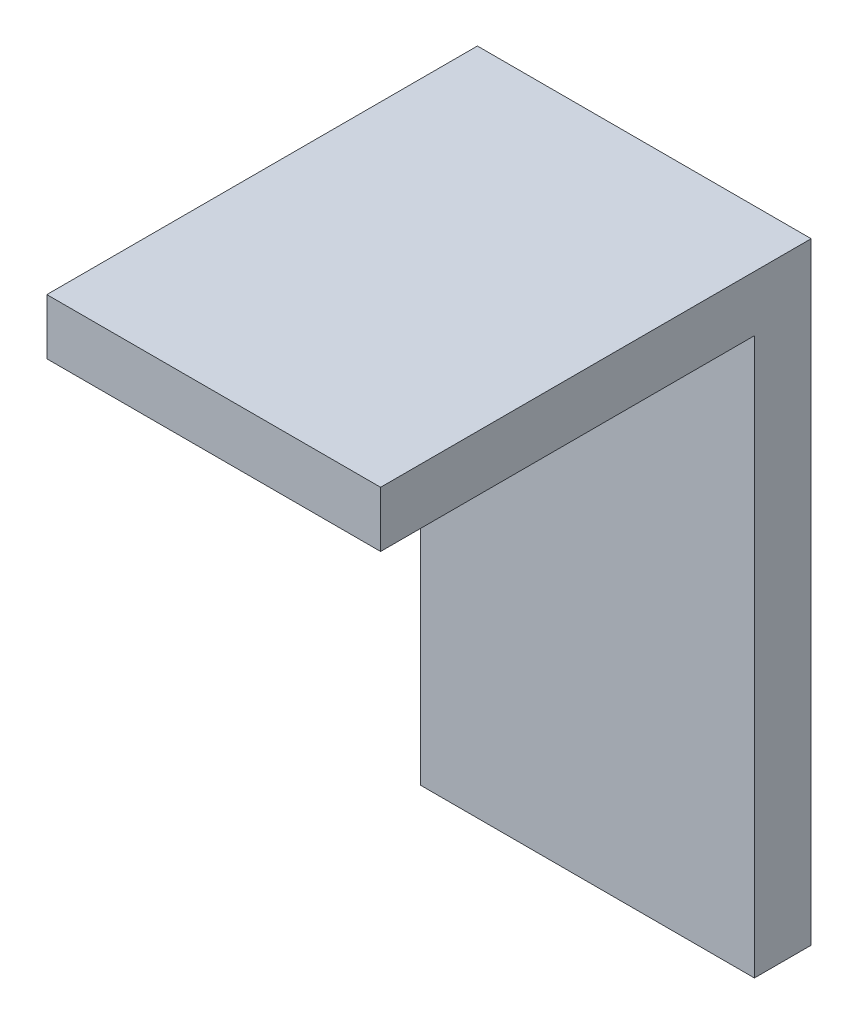
ISO-10303-21;
HEADER;
FILE_DESCRIPTION(('STEP AP214'),'2;1');
FILE_NAME('part.step','',(''),(''),'','','');
FILE_SCHEMA(('AUTOMOTIVE_DESIGN { 1 0 10303 214 1 1 1 1 }'));
ENDSEC;
DATA;
#1=APPLICATION_CONTEXT('core data for automotive mechanical design processes');
#2=APPLICATION_PROTOCOL_DEFINITION('international standard','automotive_design',2000,#1);
#3=PRODUCT_CONTEXT('',#1,'mechanical');
#4=PRODUCT('Part','Part','',(#3));
#5=PRODUCT_RELATED_PRODUCT_CATEGORY('part','',(#4));
#6=PRODUCT_DEFINITION_FORMATION('','',#4);
#7=PRODUCT_DEFINITION_CONTEXT('part definition',#1,'design');
#8=PRODUCT_DEFINITION('design','',#6,#7);
#9=PRODUCT_DEFINITION_SHAPE('','',#8);
#10=(LENGTH_UNIT() NAMED_UNIT(*) SI_UNIT(.MILLI.,.METRE.));
#11=(NAMED_UNIT(*) PLANE_ANGLE_UNIT() SI_UNIT($,.RADIAN.));
#12=(NAMED_UNIT(*) SI_UNIT($,.STERADIAN.) SOLID_ANGLE_UNIT());
#13=UNCERTAINTY_MEASURE_WITH_UNIT(LENGTH_MEASURE(1.E-05),#10,'distance_accuracy_value','');
#14=(GEOMETRIC_REPRESENTATION_CONTEXT(3) GLOBAL_UNCERTAINTY_ASSIGNED_CONTEXT((#13)) GLOBAL_UNIT_ASSIGNED_CONTEXT((#10,
#11,#12)) REPRESENTATION_CONTEXT('',''));
#15=CARTESIAN_POINT('',(0.,0.,0.));
#16=DIRECTION('',(0.,0.,1.));
#17=DIRECTION('',(1.,0.,0.));
#18=AXIS2_PLACEMENT_3D('',#15,#16,#17);
#19=CARTESIAN_POINT('',(-2.4,4.55,0.));
#20=DIRECTION('',(-1.,0.,0.));
#21=DIRECTION('',(0.,0.,1.));
#22=AXIS2_PLACEMENT_3D('',#19,#20,#21);
#23=PLANE('',#22);
#24=DIRECTION('',(0.,1.,0.));
#25=VECTOR('',#24,1.);
#26=CARTESIAN_POINT('',(-2.4,4.,0.));
#27=LINE('',#26,#25);
#28=CARTESIAN_POINT('',(-2.4,4.,0.));
#29=VERTEX_POINT('',#28);
#30=CARTESIAN_POINT('',(-2.4,4.55,0.));
#31=VERTEX_POINT('',#30);
#32=EDGE_CURVE('E11',#29,#31,#27,.T.);
#33=ORIENTED_EDGE('',*,*,#32,.F.);
#34=DIRECTION('',(0.,0.,-1.));
#35=VECTOR('',#34,1.);
#36=CARTESIAN_POINT('',(-2.4,4.,0.051));
#37=LINE('',#36,#35);
#38=CARTESIAN_POINT('',(-2.4,4.,0.051));
#39=VERTEX_POINT('',#38);
#40=EDGE_CURVE('E24',#39,#29,#37,.T.);
#41=ORIENTED_EDGE('',*,*,#40,.F.);
#42=DIRECTION('',(0.,-1.,0.));
#43=VECTOR('',#42,1.);
#44=CARTESIAN_POINT('',(-2.4,4.5,0.051));
#45=LINE('',#44,#43);
#46=CARTESIAN_POINT('',(-2.4,4.5,0.051));
#47=VERTEX_POINT('',#46);
#48=EDGE_CURVE('E87',#47,#39,#45,.T.);
#49=ORIENTED_EDGE('',*,*,#48,.F.);
#50=DIRECTION('',(0.,0.,-1.));
#51=VECTOR('',#50,1.);
#52=CARTESIAN_POINT('',(-2.4,4.5,0.387));
#53=LINE('',#52,#51);
#54=CARTESIAN_POINT('',(-2.4,4.5,0.387));
#55=VERTEX_POINT('',#54);
#56=EDGE_CURVE('E114',#55,#47,#53,.T.);
#57=ORIENTED_EDGE('',*,*,#56,.F.);
#58=DIRECTION('',(0.,-1.,0.));
#59=VECTOR('',#58,1.);
#60=CARTESIAN_POINT('',(-2.4,4.55,0.387));
#61=LINE('',#60,#59);
#62=CARTESIAN_POINT('',(-2.4,4.55,0.387));
#63=VERTEX_POINT('',#62);
#64=EDGE_CURVE('E111',#63,#55,#61,.T.);
#65=ORIENTED_EDGE('',*,*,#64,.F.);
#66=DIRECTION('',(0.,0.,1.));
#67=VECTOR('',#66,1.);
#68=CARTESIAN_POINT('',(-2.4,4.55,0.));
#69=LINE('',#68,#67);
#70=EDGE_CURVE('E108',#31,#63,#69,.T.);
#71=ORIENTED_EDGE('',*,*,#70,.F.);
#72=EDGE_LOOP('',(#33,#41,#49,#57,#65,#71));
#73=FACE_BOUND('',#72,.T.);
#74=ADVANCED_FACE('F17',(#73),#23,.T.);
#75=CARTESIAN_POINT('',(-2.1,4.,0.));
#76=DIRECTION('',(1.,0.,0.));
#77=DIRECTION('',(0.,0.,1.));
#78=AXIS2_PLACEMENT_3D('',#75,#76,#77);
#79=PLANE('',#78);
#80=DIRECTION('',(0.,-1.,0.));
#81=VECTOR('',#80,1.);
#82=CARTESIAN_POINT('',(-2.1,4.55,0.));
#83=LINE('',#82,#81);
#84=CARTESIAN_POINT('',(-2.1,4.55,0.));
#85=VERTEX_POINT('',#84);
#86=CARTESIAN_POINT('',(-2.1,4.,0.));
#87=VERTEX_POINT('',#86);
#88=EDGE_CURVE('E106',#85,#87,#83,.T.);
#89=ORIENTED_EDGE('',*,*,#88,.F.);
#90=DIRECTION('',(0.,0.,-1.));
#91=VECTOR('',#90,1.);
#92=CARTESIAN_POINT('',(-2.1,4.55,0.387));
#93=LINE('',#92,#91);
#94=CARTESIAN_POINT('',(-2.1,4.55,0.387));
#95=VERTEX_POINT('',#94);
#96=EDGE_CURVE('E103',#95,#85,#93,.T.);
#97=ORIENTED_EDGE('',*,*,#96,.F.);
#98=DIRECTION('',(0.,1.,0.));
#99=VECTOR('',#98,1.);
#100=CARTESIAN_POINT('',(-2.1,4.5,0.387));
#101=LINE('',#100,#99);
#102=CARTESIAN_POINT('',(-2.1,4.5,0.387));
#103=VERTEX_POINT('',#102);
#104=EDGE_CURVE('E100',#103,#95,#101,.T.);
#105=ORIENTED_EDGE('',*,*,#104,.F.);
#106=DIRECTION('',(0.,0.,1.));
#107=VECTOR('',#106,1.);
#108=CARTESIAN_POINT('',(-2.1,4.5,0.051));
#109=LINE('',#108,#107);
#110=CARTESIAN_POINT('',(-2.1,4.5,0.051));
#111=VERTEX_POINT('',#110);
#112=EDGE_CURVE('E72',#111,#103,#109,.T.);
#113=ORIENTED_EDGE('',*,*,#112,.F.);
#114=DIRECTION('',(0.,1.,0.));
#115=VECTOR('',#114,1.);
#116=CARTESIAN_POINT('',(-2.1,4.,0.051));
#117=LINE('',#116,#115);
#118=CARTESIAN_POINT('',(-2.1,4.,0.051));
#119=VERTEX_POINT('',#118);
#120=EDGE_CURVE('E66',#119,#111,#117,.T.);
#121=ORIENTED_EDGE('',*,*,#120,.F.);
#122=DIRECTION('',(0.,0.,1.));
#123=VECTOR('',#122,1.);
#124=CARTESIAN_POINT('',(-2.1,4.,0.));
#125=LINE('',#124,#123);
#126=EDGE_CURVE('E69',#87,#119,#125,.T.);
#127=ORIENTED_EDGE('',*,*,#126,.F.);
#128=EDGE_LOOP('',(#89,#97,#105,#113,#121,#127));
#129=FACE_BOUND('',#128,.T.);
#130=ADVANCED_FACE('F68',(#129),#79,.T.);
#131=CARTESIAN_POINT('',(-2.4,4.55,0.387));
#132=DIRECTION('',(0.,0.,1.));
#133=DIRECTION('',(0.,1.,0.));
#134=AXIS2_PLACEMENT_3D('',#131,#132,#133);
#135=PLANE('',#134);
#136=ORIENTED_EDGE('',*,*,#64,.T.);
#137=DIRECTION('',(-1.,0.,0.));
#138=VECTOR('',#137,1.);
#139=CARTESIAN_POINT('',(-2.1,4.5,0.387));
#140=LINE('',#139,#138);
#141=EDGE_CURVE('E83',#103,#55,#140,.T.);
#142=ORIENTED_EDGE('',*,*,#141,.F.);
#143=ORIENTED_EDGE('',*,*,#104,.T.);
#144=DIRECTION('',(1.,0.,0.));
#145=VECTOR('',#144,1.);
#146=CARTESIAN_POINT('',(-2.4,4.55,0.387));
#147=LINE('',#146,#145);
#148=EDGE_CURVE('E88',#63,#95,#147,.T.);
#149=ORIENTED_EDGE('',*,*,#148,.F.);
#150=EDGE_LOOP('',(#136,#142,#143,#149));
#151=FACE_BOUND('',#150,.T.);
#152=ADVANCED_FACE('F125',(#151),#135,.T.);
#153=CARTESIAN_POINT('',(-2.4,4.5,0.051));
#154=DIRECTION('',(0.,0.,1.));
#155=DIRECTION('',(0.,1.,0.));
#156=AXIS2_PLACEMENT_3D('',#153,#154,#155);
#157=PLANE('',#156);
#158=ORIENTED_EDGE('',*,*,#48,.T.);
#159=DIRECTION('',(-1.,0.,0.));
#160=VECTOR('',#159,1.);
#161=CARTESIAN_POINT('',(-2.1,4.,0.051));
#162=LINE('',#161,#160);
#163=EDGE_CURVE('E81',#119,#39,#162,.T.);
#164=ORIENTED_EDGE('',*,*,#163,.F.);
#165=ORIENTED_EDGE('',*,*,#120,.T.);
#166=DIRECTION('',(1.,0.,0.));
#167=VECTOR('',#166,1.);
#168=CARTESIAN_POINT('',(-2.4,4.5,0.051));
#169=LINE('',#168,#167);
#170=EDGE_CURVE('E89',#47,#111,#169,.T.);
#171=ORIENTED_EDGE('',*,*,#170,.F.);
#172=EDGE_LOOP('',(#158,#164,#165,#171));
#173=FACE_BOUND('',#172,.T.);
#174=ADVANCED_FACE('F86',(#173),#157,.T.);
#175=CARTESIAN_POINT('',(-2.1,4.55,0.));
#176=DIRECTION('',(0.,1.,0.));
#177=DIRECTION('',(0.,0.,1.));
#178=AXIS2_PLACEMENT_3D('',#175,#176,#177);
#179=PLANE('',#178);
#180=DIRECTION('',(1.,0.,0.));
#181=VECTOR('',#180,1.);
#182=CARTESIAN_POINT('',(-2.4,4.55,0.));
#183=LINE('',#182,#181);
#184=EDGE_CURVE('E93',#31,#85,#183,.T.);
#185=ORIENTED_EDGE('',*,*,#184,.F.);
#186=ORIENTED_EDGE('',*,*,#70,.T.);
#187=ORIENTED_EDGE('',*,*,#148,.T.);
#188=ORIENTED_EDGE('',*,*,#96,.T.);
#189=EDGE_LOOP('',(#185,#186,#187,#188));
#190=FACE_BOUND('',#189,.T.);
#191=ADVANCED_FACE('F121',(#190),#179,.T.);
#192=CARTESIAN_POINT('',(-2.4,4.,0.));
#193=DIRECTION('',(0.,-1.,0.));
#194=DIRECTION('',(0.,0.,1.));
#195=AXIS2_PLACEMENT_3D('',#192,#193,#194);
#196=PLANE('',#195);
#197=DIRECTION('',(-1.,0.,0.));
#198=VECTOR('',#197,1.);
#199=CARTESIAN_POINT('',(-2.1,4.,0.));
#200=LINE('',#199,#198);
#201=EDGE_CURVE('E82',#87,#29,#200,.T.);
#202=ORIENTED_EDGE('',*,*,#201,.F.);
#203=ORIENTED_EDGE('',*,*,#126,.T.);
#204=ORIENTED_EDGE('',*,*,#163,.T.);
#205=ORIENTED_EDGE('',*,*,#40,.T.);
#206=EDGE_LOOP('',(#202,#203,#204,#205));
#207=FACE_BOUND('',#206,.T.);
#208=ADVANCED_FACE('F80',(#207),#196,.T.);
#209=CARTESIAN_POINT('',(-2.4,4.5,0.051));
#210=DIRECTION('',(0.,-1.,0.));
#211=DIRECTION('',(0.,0.,1.));
#212=AXIS2_PLACEMENT_3D('',#209,#210,#211);
#213=PLANE('',#212);
#214=ORIENTED_EDGE('',*,*,#170,.T.);
#215=ORIENTED_EDGE('',*,*,#112,.T.);
#216=ORIENTED_EDGE('',*,*,#141,.T.);
#217=ORIENTED_EDGE('',*,*,#56,.T.);
#218=EDGE_LOOP('',(#214,#215,#216,#217));
#219=FACE_BOUND('',#218,.T.);
#220=ADVANCED_FACE('F127',(#219),#213,.T.);
#221=CARTESIAN_POINT('',(-2.1,4.55,0.));
#222=DIRECTION('',(0.,0.,-1.));
#223=DIRECTION('',(0.,1.,0.));
#224=AXIS2_PLACEMENT_3D('',#221,#222,#223);
#225=PLANE('',#224);
#226=ORIENTED_EDGE('',*,*,#88,.T.);
#227=ORIENTED_EDGE('',*,*,#201,.T.);
#228=ORIENTED_EDGE('',*,*,#32,.T.);
#229=ORIENTED_EDGE('',*,*,#184,.T.);
#230=EDGE_LOOP('',(#226,#227,#228,#229));
#231=FACE_BOUND('',#230,.T.);
#232=ADVANCED_FACE('F117',(#231),#225,.T.);
#233=CLOSED_SHELL('',(#74,#130,#152,#174,#191,#208,#220,#232));
#234=MANIFOLD_SOLID_BREP('B1',#233);
#235=ADVANCED_BREP_SHAPE_REPRESENTATION('',(#18,#234),#14);
#236=SHAPE_DEFINITION_REPRESENTATION(#9,#235);
ENDSEC;
END-ISO-10303-21;
